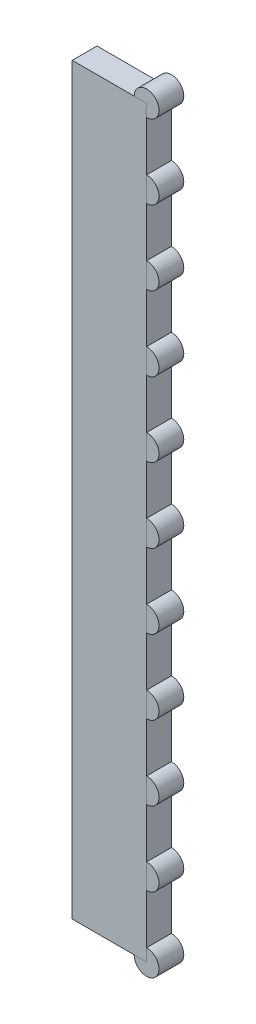
ISO-10303-21;
HEADER;
FILE_DESCRIPTION(('STEP AP214'),'2;1');
FILE_NAME('part.step','',(''),(''),'','','');
FILE_SCHEMA(('AUTOMOTIVE_DESIGN { 1 0 10303 214 1 1 1 1 }'));
ENDSEC;
DATA;
#1=APPLICATION_CONTEXT('core data for automotive mechanical design processes');
#2=APPLICATION_PROTOCOL_DEFINITION('international standard','automotive_design',2000,#1);
#3=PRODUCT_CONTEXT('',#1,'mechanical');
#4=PRODUCT('Part','Part','',(#3));
#5=PRODUCT_RELATED_PRODUCT_CATEGORY('part','',(#4));
#6=PRODUCT_DEFINITION_FORMATION('','',#4);
#7=PRODUCT_DEFINITION_CONTEXT('part definition',#1,'design');
#8=PRODUCT_DEFINITION('design','',#6,#7);
#9=PRODUCT_DEFINITION_SHAPE('','',#8);
#10=(LENGTH_UNIT() NAMED_UNIT(*) SI_UNIT(.MILLI.,.METRE.));
#11=(NAMED_UNIT(*) PLANE_ANGLE_UNIT() SI_UNIT($,.RADIAN.));
#12=(NAMED_UNIT(*) SI_UNIT($,.STERADIAN.) SOLID_ANGLE_UNIT());
#13=UNCERTAINTY_MEASURE_WITH_UNIT(LENGTH_MEASURE(1.E-05),#10,'distance_accuracy_value','');
#14=(GEOMETRIC_REPRESENTATION_CONTEXT(3) GLOBAL_UNCERTAINTY_ASSIGNED_CONTEXT((#13)) GLOBAL_UNIT_ASSIGNED_CONTEXT((#10,
#11,#12)) REPRESENTATION_CONTEXT('',''));
#15=CARTESIAN_POINT('',(0.,0.,0.));
#16=DIRECTION('',(0.,0.,1.));
#17=DIRECTION('',(1.,0.,0.));
#18=AXIS2_PLACEMENT_3D('',#15,#16,#17);
#19=CARTESIAN_POINT('',(30.0000000000031,0.,0.));
#20=DIRECTION('',(0.,0.,1.));
#21=DIRECTION('',(1.,0.,0.));
#22=AXIS2_PLACEMENT_3D('',#19,#20,#21);
#23=CYLINDRICAL_SURFACE('',#22,5.);
#24=CARTESIAN_POINT('',(30.0000000000031,0.,0.));
#25=DIRECTION('',(0.,0.,1.));
#26=DIRECTION('',(1.,0.,0.));
#27=AXIS2_PLACEMENT_3D('',#24,#25,#26);
#28=CIRCLE('',#27,5.);
#29=CARTESIAN_POINT('',(35.0000000000031,0.,0.));
#30=VERTEX_POINT('',#29);
#31=EDGE_CURVE('E11',#30,#30,#28,.T.);
#32=ORIENTED_EDGE('',*,*,#31,.T.);
#33=EDGE_LOOP('',(#32));
#34=FACE_BOUND('',#33,.T.);
#35=CARTESIAN_POINT('',(30.0000000000031,0.,10.));
#36=DIRECTION('',(0.,0.,1.));
#37=DIRECTION('',(1.,0.,0.));
#38=AXIS2_PLACEMENT_3D('',#35,#36,#37);
#39=CIRCLE('',#38,5.);
#40=CARTESIAN_POINT('',(35.0000000000031,0.,10.));
#41=VERTEX_POINT('',#40);
#42=EDGE_CURVE('E45',#41,#41,#39,.T.);
#43=ORIENTED_EDGE('',*,*,#42,.F.);
#44=EDGE_LOOP('',(#43));
#45=FACE_BOUND('',#44,.T.);
#46=ADVANCED_FACE('F42',(#34,#45),#23,.T.);
#47=CARTESIAN_POINT('',(30.0000000000031,0.,0.));
#48=DIRECTION('',(0.,0.,1.));
#49=DIRECTION('',(1.,0.,0.));
#50=AXIS2_PLACEMENT_3D('',#47,#48,#49);
#51=PLANE('',#50);
#52=ORIENTED_EDGE('',*,*,#31,.F.);
#53=EDGE_LOOP('',(#52));
#54=FACE_BOUND('',#53,.T.);
#55=ADVANCED_FACE('F57',(#54),#51,.F.);
#56=CARTESIAN_POINT('',(30.0000000000031,0.,10.));
#57=DIRECTION('',(0.,0.,1.));
#58=DIRECTION('',(1.,0.,0.));
#59=AXIS2_PLACEMENT_3D('',#56,#57,#58);
#60=PLANE('',#59);
#61=ORIENTED_EDGE('',*,*,#42,.T.);
#62=EDGE_LOOP('',(#61));
#63=FACE_BOUND('',#62,.T.);
#64=ADVANCED_FACE('F54',(#63),#60,.T.);
#65=CLOSED_SHELL('',(#46,#55,#64));
#66=MANIFOLD_SOLID_BREP('B2',#65);
#67=CARTESIAN_POINT('',(30.0000000000028,30.,0.));
#68=DIRECTION('',(0.,0.,1.));
#69=DIRECTION('',(1.,0.,0.));
#70=AXIS2_PLACEMENT_3D('',#67,#68,#69);
#71=CYLINDRICAL_SURFACE('',#70,5.);
#72=CARTESIAN_POINT('',(30.0000000000028,30.,0.));
#73=DIRECTION('',(0.,0.,1.));
#74=DIRECTION('',(1.,0.,0.));
#75=AXIS2_PLACEMENT_3D('',#72,#73,#74);
#76=CIRCLE('',#75,5.);
#77=CARTESIAN_POINT('',(35.0000000000028,30.,0.));
#78=VERTEX_POINT('',#77);
#79=EDGE_CURVE('E41',#78,#78,#76,.T.);
#80=ORIENTED_EDGE('',*,*,#79,.T.);
#81=EDGE_LOOP('',(#80));
#82=FACE_BOUND('',#81,.T.);
#83=CARTESIAN_POINT('',(30.0000000000028,30.,10.));
#84=DIRECTION('',(0.,0.,1.));
#85=DIRECTION('',(1.,0.,0.));
#86=AXIS2_PLACEMENT_3D('',#83,#84,#85);
#87=CIRCLE('',#86,5.);
#88=CARTESIAN_POINT('',(35.0000000000028,30.,10.));
#89=VERTEX_POINT('',#88);
#90=EDGE_CURVE('E94',#89,#89,#87,.T.);
#91=ORIENTED_EDGE('',*,*,#90,.F.);
#92=EDGE_LOOP('',(#91));
#93=FACE_BOUND('',#92,.T.);
#94=ADVANCED_FACE('F91',(#82,#93),#71,.T.);
#95=CARTESIAN_POINT('',(30.0000000000028,30.,0.));
#96=DIRECTION('',(0.,0.,1.));
#97=DIRECTION('',(1.,0.,0.));
#98=AXIS2_PLACEMENT_3D('',#95,#96,#97);
#99=PLANE('',#98);
#100=ORIENTED_EDGE('',*,*,#79,.F.);
#101=EDGE_LOOP('',(#100));
#102=FACE_BOUND('',#101,.T.);
#103=ADVANCED_FACE('F106',(#102),#99,.F.);
#104=CARTESIAN_POINT('',(30.0000000000028,30.,10.));
#105=DIRECTION('',(0.,0.,1.));
#106=DIRECTION('',(1.,0.,0.));
#107=AXIS2_PLACEMENT_3D('',#104,#105,#106);
#108=PLANE('',#107);
#109=ORIENTED_EDGE('',*,*,#90,.T.);
#110=EDGE_LOOP('',(#109));
#111=FACE_BOUND('',#110,.T.);
#112=ADVANCED_FACE('F103',(#111),#108,.T.);
#113=CLOSED_SHELL('',(#94,#103,#112));
#114=MANIFOLD_SOLID_BREP('B6',#113);
#115=CARTESIAN_POINT('',(30.0000000000025,60.,0.));
#116=DIRECTION('',(0.,0.,1.));
#117=DIRECTION('',(1.,0.,0.));
#118=AXIS2_PLACEMENT_3D('',#115,#116,#117);
#119=CYLINDRICAL_SURFACE('',#118,5.);
#120=CARTESIAN_POINT('',(30.0000000000025,60.,0.));
#121=DIRECTION('',(0.,0.,1.));
#122=DIRECTION('',(1.,0.,0.));
#123=AXIS2_PLACEMENT_3D('',#120,#121,#122);
#124=CIRCLE('',#123,5.);
#125=CARTESIAN_POINT('',(35.0000000000025,60.,0.));
#126=VERTEX_POINT('',#125);
#127=EDGE_CURVE('E90',#126,#126,#124,.T.);
#128=ORIENTED_EDGE('',*,*,#127,.T.);
#129=EDGE_LOOP('',(#128));
#130=FACE_BOUND('',#129,.T.);
#131=CARTESIAN_POINT('',(30.0000000000025,60.,10.));
#132=DIRECTION('',(0.,0.,1.));
#133=DIRECTION('',(1.,0.,0.));
#134=AXIS2_PLACEMENT_3D('',#131,#132,#133);
#135=CIRCLE('',#134,5.);
#136=CARTESIAN_POINT('',(35.0000000000025,60.,10.));
#137=VERTEX_POINT('',#136);
#138=EDGE_CURVE('E143',#137,#137,#135,.T.);
#139=ORIENTED_EDGE('',*,*,#138,.F.);
#140=EDGE_LOOP('',(#139));
#141=FACE_BOUND('',#140,.T.);
#142=ADVANCED_FACE('F140',(#130,#141),#119,.T.);
#143=CARTESIAN_POINT('',(30.0000000000025,60.,0.));
#144=DIRECTION('',(0.,0.,1.));
#145=DIRECTION('',(1.,0.,0.));
#146=AXIS2_PLACEMENT_3D('',#143,#144,#145);
#147=PLANE('',#146);
#148=ORIENTED_EDGE('',*,*,#127,.F.);
#149=EDGE_LOOP('',(#148));
#150=FACE_BOUND('',#149,.T.);
#151=ADVANCED_FACE('F155',(#150),#147,.F.);
#152=CARTESIAN_POINT('',(30.0000000000025,60.,10.));
#153=DIRECTION('',(0.,0.,1.));
#154=DIRECTION('',(1.,0.,0.));
#155=AXIS2_PLACEMENT_3D('',#152,#153,#154);
#156=PLANE('',#155);
#157=ORIENTED_EDGE('',*,*,#138,.T.);
#158=EDGE_LOOP('',(#157));
#159=FACE_BOUND('',#158,.T.);
#160=ADVANCED_FACE('F152',(#159),#156,.T.);
#161=CLOSED_SHELL('',(#142,#151,#160));
#162=MANIFOLD_SOLID_BREP('B36',#161);
#163=CARTESIAN_POINT('',(30.0000000000022,90.,0.));
#164=DIRECTION('',(0.,0.,1.));
#165=DIRECTION('',(1.,0.,0.));
#166=AXIS2_PLACEMENT_3D('',#163,#164,#165);
#167=CYLINDRICAL_SURFACE('',#166,5.);
#168=CARTESIAN_POINT('',(30.0000000000022,90.,0.));
#169=DIRECTION('',(0.,0.,1.));
#170=DIRECTION('',(1.,0.,0.));
#171=AXIS2_PLACEMENT_3D('',#168,#169,#170);
#172=CIRCLE('',#171,5.);
#173=CARTESIAN_POINT('',(35.0000000000022,90.,0.));
#174=VERTEX_POINT('',#173);
#175=EDGE_CURVE('E139',#174,#174,#172,.T.);
#176=ORIENTED_EDGE('',*,*,#175,.T.);
#177=EDGE_LOOP('',(#176));
#178=FACE_BOUND('',#177,.T.);
#179=CARTESIAN_POINT('',(30.0000000000022,90.,10.));
#180=DIRECTION('',(0.,0.,1.));
#181=DIRECTION('',(1.,0.,0.));
#182=AXIS2_PLACEMENT_3D('',#179,#180,#181);
#183=CIRCLE('',#182,5.);
#184=CARTESIAN_POINT('',(35.0000000000022,90.,10.));
#185=VERTEX_POINT('',#184);
#186=EDGE_CURVE('E192',#185,#185,#183,.T.);
#187=ORIENTED_EDGE('',*,*,#186,.F.);
#188=EDGE_LOOP('',(#187));
#189=FACE_BOUND('',#188,.T.);
#190=ADVANCED_FACE('F189',(#178,#189),#167,.T.);
#191=CARTESIAN_POINT('',(30.0000000000022,90.,0.));
#192=DIRECTION('',(0.,0.,1.));
#193=DIRECTION('',(1.,0.,0.));
#194=AXIS2_PLACEMENT_3D('',#191,#192,#193);
#195=PLANE('',#194);
#196=ORIENTED_EDGE('',*,*,#175,.F.);
#197=EDGE_LOOP('',(#196));
#198=FACE_BOUND('',#197,.T.);
#199=ADVANCED_FACE('F204',(#198),#195,.F.);
#200=CARTESIAN_POINT('',(30.0000000000022,90.,10.));
#201=DIRECTION('',(0.,0.,1.));
#202=DIRECTION('',(1.,0.,0.));
#203=AXIS2_PLACEMENT_3D('',#200,#201,#202);
#204=PLANE('',#203);
#205=ORIENTED_EDGE('',*,*,#186,.T.);
#206=EDGE_LOOP('',(#205));
#207=FACE_BOUND('',#206,.T.);
#208=ADVANCED_FACE('F201',(#207),#204,.T.);
#209=CLOSED_SHELL('',(#190,#199,#208));
#210=MANIFOLD_SOLID_BREP('B85',#209);
#211=CARTESIAN_POINT('',(30.0000000000019,120.,0.));
#212=DIRECTION('',(0.,0.,1.));
#213=DIRECTION('',(1.,0.,0.));
#214=AXIS2_PLACEMENT_3D('',#211,#212,#213);
#215=CYLINDRICAL_SURFACE('',#214,5.);
#216=CARTESIAN_POINT('',(30.0000000000019,120.,0.));
#217=DIRECTION('',(0.,0.,1.));
#218=DIRECTION('',(1.,0.,0.));
#219=AXIS2_PLACEMENT_3D('',#216,#217,#218);
#220=CIRCLE('',#219,5.);
#221=CARTESIAN_POINT('',(35.0000000000019,120.,0.));
#222=VERTEX_POINT('',#221);
#223=EDGE_CURVE('E188',#222,#222,#220,.T.);
#224=ORIENTED_EDGE('',*,*,#223,.T.);
#225=EDGE_LOOP('',(#224));
#226=FACE_BOUND('',#225,.T.);
#227=CARTESIAN_POINT('',(30.0000000000019,120.,10.));
#228=DIRECTION('',(0.,0.,1.));
#229=DIRECTION('',(1.,0.,0.));
#230=AXIS2_PLACEMENT_3D('',#227,#228,#229);
#231=CIRCLE('',#230,5.);
#232=CARTESIAN_POINT('',(35.0000000000019,120.,10.));
#233=VERTEX_POINT('',#232);
#234=EDGE_CURVE('E241',#233,#233,#231,.T.);
#235=ORIENTED_EDGE('',*,*,#234,.F.);
#236=EDGE_LOOP('',(#235));
#237=FACE_BOUND('',#236,.T.);
#238=ADVANCED_FACE('F238',(#226,#237),#215,.T.);
#239=CARTESIAN_POINT('',(30.0000000000019,120.,0.));
#240=DIRECTION('',(0.,0.,1.));
#241=DIRECTION('',(1.,0.,0.));
#242=AXIS2_PLACEMENT_3D('',#239,#240,#241);
#243=PLANE('',#242);
#244=ORIENTED_EDGE('',*,*,#223,.F.);
#245=EDGE_LOOP('',(#244));
#246=FACE_BOUND('',#245,.T.);
#247=ADVANCED_FACE('F253',(#246),#243,.F.);
#248=CARTESIAN_POINT('',(30.0000000000019,120.,10.));
#249=DIRECTION('',(0.,0.,1.));
#250=DIRECTION('',(1.,0.,0.));
#251=AXIS2_PLACEMENT_3D('',#248,#249,#250);
#252=PLANE('',#251);
#253=ORIENTED_EDGE('',*,*,#234,.T.);
#254=EDGE_LOOP('',(#253));
#255=FACE_BOUND('',#254,.T.);
#256=ADVANCED_FACE('F250',(#255),#252,.T.);
#257=CLOSED_SHELL('',(#238,#247,#256));
#258=MANIFOLD_SOLID_BREP('B134',#257);
#259=CARTESIAN_POINT('',(30.0000000000016,150.,0.));
#260=DIRECTION('',(0.,0.,1.));
#261=DIRECTION('',(1.,0.,0.));
#262=AXIS2_PLACEMENT_3D('',#259,#260,#261);
#263=CYLINDRICAL_SURFACE('',#262,5.);
#264=CARTESIAN_POINT('',(30.0000000000016,150.,0.));
#265=DIRECTION('',(0.,0.,1.));
#266=DIRECTION('',(1.,0.,0.));
#267=AXIS2_PLACEMENT_3D('',#264,#265,#266);
#268=CIRCLE('',#267,5.);
#269=CARTESIAN_POINT('',(35.0000000000016,150.,0.));
#270=VERTEX_POINT('',#269);
#271=EDGE_CURVE('E237',#270,#270,#268,.T.);
#272=ORIENTED_EDGE('',*,*,#271,.T.);
#273=EDGE_LOOP('',(#272));
#274=FACE_BOUND('',#273,.T.);
#275=CARTESIAN_POINT('',(30.0000000000016,150.,10.));
#276=DIRECTION('',(0.,0.,1.));
#277=DIRECTION('',(1.,0.,0.));
#278=AXIS2_PLACEMENT_3D('',#275,#276,#277);
#279=CIRCLE('',#278,5.);
#280=CARTESIAN_POINT('',(35.0000000000016,150.,10.));
#281=VERTEX_POINT('',#280);
#282=EDGE_CURVE('E290',#281,#281,#279,.T.);
#283=ORIENTED_EDGE('',*,*,#282,.F.);
#284=EDGE_LOOP('',(#283));
#285=FACE_BOUND('',#284,.T.);
#286=ADVANCED_FACE('F287',(#274,#285),#263,.T.);
#287=CARTESIAN_POINT('',(30.0000000000016,150.,0.));
#288=DIRECTION('',(0.,0.,1.));
#289=DIRECTION('',(1.,0.,0.));
#290=AXIS2_PLACEMENT_3D('',#287,#288,#289);
#291=PLANE('',#290);
#292=ORIENTED_EDGE('',*,*,#271,.F.);
#293=EDGE_LOOP('',(#292));
#294=FACE_BOUND('',#293,.T.);
#295=ADVANCED_FACE('F302',(#294),#291,.F.);
#296=CARTESIAN_POINT('',(30.0000000000016,150.,10.));
#297=DIRECTION('',(0.,0.,1.));
#298=DIRECTION('',(1.,0.,0.));
#299=AXIS2_PLACEMENT_3D('',#296,#297,#298);
#300=PLANE('',#299);
#301=ORIENTED_EDGE('',*,*,#282,.T.);
#302=EDGE_LOOP('',(#301));
#303=FACE_BOUND('',#302,.T.);
#304=ADVANCED_FACE('F299',(#303),#300,.T.);
#305=CLOSED_SHELL('',(#286,#295,#304));
#306=MANIFOLD_SOLID_BREP('B183',#305);
#307=CARTESIAN_POINT('',(30.0000000000012,180.,0.));
#308=DIRECTION('',(0.,0.,1.));
#309=DIRECTION('',(1.,0.,0.));
#310=AXIS2_PLACEMENT_3D('',#307,#308,#309);
#311=CYLINDRICAL_SURFACE('',#310,5.);
#312=CARTESIAN_POINT('',(30.0000000000012,180.,0.));
#313=DIRECTION('',(0.,0.,1.));
#314=DIRECTION('',(1.,0.,0.));
#315=AXIS2_PLACEMENT_3D('',#312,#313,#314);
#316=CIRCLE('',#315,5.);
#317=CARTESIAN_POINT('',(35.0000000000012,180.,0.));
#318=VERTEX_POINT('',#317);
#319=EDGE_CURVE('E286',#318,#318,#316,.T.);
#320=ORIENTED_EDGE('',*,*,#319,.T.);
#321=EDGE_LOOP('',(#320));
#322=FACE_BOUND('',#321,.T.);
#323=CARTESIAN_POINT('',(30.0000000000012,180.,10.));
#324=DIRECTION('',(0.,0.,1.));
#325=DIRECTION('',(1.,0.,0.));
#326=AXIS2_PLACEMENT_3D('',#323,#324,#325);
#327=CIRCLE('',#326,5.);
#328=CARTESIAN_POINT('',(35.0000000000012,180.,10.));
#329=VERTEX_POINT('',#328);
#330=EDGE_CURVE('E339',#329,#329,#327,.T.);
#331=ORIENTED_EDGE('',*,*,#330,.F.);
#332=EDGE_LOOP('',(#331));
#333=FACE_BOUND('',#332,.T.);
#334=ADVANCED_FACE('F336',(#322,#333),#311,.T.);
#335=CARTESIAN_POINT('',(30.0000000000012,180.,0.));
#336=DIRECTION('',(0.,0.,1.));
#337=DIRECTION('',(1.,0.,0.));
#338=AXIS2_PLACEMENT_3D('',#335,#336,#337);
#339=PLANE('',#338);
#340=ORIENTED_EDGE('',*,*,#319,.F.);
#341=EDGE_LOOP('',(#340));
#342=FACE_BOUND('',#341,.T.);
#343=ADVANCED_FACE('F351',(#342),#339,.F.);
#344=CARTESIAN_POINT('',(30.0000000000012,180.,10.));
#345=DIRECTION('',(0.,0.,1.));
#346=DIRECTION('',(1.,0.,0.));
#347=AXIS2_PLACEMENT_3D('',#344,#345,#346);
#348=PLANE('',#347);
#349=ORIENTED_EDGE('',*,*,#330,.T.);
#350=EDGE_LOOP('',(#349));
#351=FACE_BOUND('',#350,.T.);
#352=ADVANCED_FACE('F348',(#351),#348,.T.);
#353=CLOSED_SHELL('',(#334,#343,#352));
#354=MANIFOLD_SOLID_BREP('B232',#353);
#355=CARTESIAN_POINT('',(30.0000000000009,210.,0.));
#356=DIRECTION('',(0.,0.,1.));
#357=DIRECTION('',(1.,0.,0.));
#358=AXIS2_PLACEMENT_3D('',#355,#356,#357);
#359=CYLINDRICAL_SURFACE('',#358,5.);
#360=CARTESIAN_POINT('',(30.0000000000009,210.,0.));
#361=DIRECTION('',(0.,0.,1.));
#362=DIRECTION('',(1.,0.,0.));
#363=AXIS2_PLACEMENT_3D('',#360,#361,#362);
#364=CIRCLE('',#363,5.);
#365=CARTESIAN_POINT('',(35.0000000000009,210.,0.));
#366=VERTEX_POINT('',#365);
#367=EDGE_CURVE('E335',#366,#366,#364,.T.);
#368=ORIENTED_EDGE('',*,*,#367,.T.);
#369=EDGE_LOOP('',(#368));
#370=FACE_BOUND('',#369,.T.);
#371=CARTESIAN_POINT('',(30.0000000000009,210.,10.));
#372=DIRECTION('',(0.,0.,1.));
#373=DIRECTION('',(1.,0.,0.));
#374=AXIS2_PLACEMENT_3D('',#371,#372,#373);
#375=CIRCLE('',#374,5.);
#376=CARTESIAN_POINT('',(35.0000000000009,210.,10.));
#377=VERTEX_POINT('',#376);
#378=EDGE_CURVE('E388',#377,#377,#375,.T.);
#379=ORIENTED_EDGE('',*,*,#378,.F.);
#380=EDGE_LOOP('',(#379));
#381=FACE_BOUND('',#380,.T.);
#382=ADVANCED_FACE('F385',(#370,#381),#359,.T.);
#383=CARTESIAN_POINT('',(30.0000000000009,210.,0.));
#384=DIRECTION('',(0.,0.,1.));
#385=DIRECTION('',(1.,0.,0.));
#386=AXIS2_PLACEMENT_3D('',#383,#384,#385);
#387=PLANE('',#386);
#388=ORIENTED_EDGE('',*,*,#367,.F.);
#389=EDGE_LOOP('',(#388));
#390=FACE_BOUND('',#389,.T.);
#391=ADVANCED_FACE('F400',(#390),#387,.F.);
#392=CARTESIAN_POINT('',(30.0000000000009,210.,10.));
#393=DIRECTION('',(0.,0.,1.));
#394=DIRECTION('',(1.,0.,0.));
#395=AXIS2_PLACEMENT_3D('',#392,#393,#394);
#396=PLANE('',#395);
#397=ORIENTED_EDGE('',*,*,#378,.T.);
#398=EDGE_LOOP('',(#397));
#399=FACE_BOUND('',#398,.T.);
#400=ADVANCED_FACE('F397',(#399),#396,.T.);
#401=CLOSED_SHELL('',(#382,#391,#400));
#402=MANIFOLD_SOLID_BREP('B281',#401);
#403=CARTESIAN_POINT('',(30.0000000000006,240.,0.));
#404=DIRECTION('',(0.,0.,1.));
#405=DIRECTION('',(1.,0.,0.));
#406=AXIS2_PLACEMENT_3D('',#403,#404,#405);
#407=CYLINDRICAL_SURFACE('',#406,5.);
#408=CARTESIAN_POINT('',(30.0000000000006,240.,0.));
#409=DIRECTION('',(0.,0.,1.));
#410=DIRECTION('',(1.,0.,0.));
#411=AXIS2_PLACEMENT_3D('',#408,#409,#410);
#412=CIRCLE('',#411,5.);
#413=CARTESIAN_POINT('',(35.0000000000006,240.,0.));
#414=VERTEX_POINT('',#413);
#415=EDGE_CURVE('E384',#414,#414,#412,.T.);
#416=ORIENTED_EDGE('',*,*,#415,.T.);
#417=EDGE_LOOP('',(#416));
#418=FACE_BOUND('',#417,.T.);
#419=CARTESIAN_POINT('',(30.0000000000006,240.,10.));
#420=DIRECTION('',(0.,0.,1.));
#421=DIRECTION('',(1.,0.,0.));
#422=AXIS2_PLACEMENT_3D('',#419,#420,#421);
#423=CIRCLE('',#422,5.);
#424=CARTESIAN_POINT('',(35.0000000000006,240.,10.));
#425=VERTEX_POINT('',#424);
#426=EDGE_CURVE('E437',#425,#425,#423,.T.);
#427=ORIENTED_EDGE('',*,*,#426,.F.);
#428=EDGE_LOOP('',(#427));
#429=FACE_BOUND('',#428,.T.);
#430=ADVANCED_FACE('F434',(#418,#429),#407,.T.);
#431=CARTESIAN_POINT('',(30.0000000000006,240.,0.));
#432=DIRECTION('',(0.,0.,1.));
#433=DIRECTION('',(1.,0.,0.));
#434=AXIS2_PLACEMENT_3D('',#431,#432,#433);
#435=PLANE('',#434);
#436=ORIENTED_EDGE('',*,*,#415,.F.);
#437=EDGE_LOOP('',(#436));
#438=FACE_BOUND('',#437,.T.);
#439=ADVANCED_FACE('F449',(#438),#435,.F.);
#440=CARTESIAN_POINT('',(30.0000000000006,240.,10.));
#441=DIRECTION('',(0.,0.,1.));
#442=DIRECTION('',(1.,0.,0.));
#443=AXIS2_PLACEMENT_3D('',#440,#441,#442);
#444=PLANE('',#443);
#445=ORIENTED_EDGE('',*,*,#426,.T.);
#446=EDGE_LOOP('',(#445));
#447=FACE_BOUND('',#446,.T.);
#448=ADVANCED_FACE('F446',(#447),#444,.T.);
#449=CLOSED_SHELL('',(#430,#439,#448));
#450=MANIFOLD_SOLID_BREP('B330',#449);
#451=CARTESIAN_POINT('',(30.0000000000003,270.,0.));
#452=DIRECTION('',(0.,0.,1.));
#453=DIRECTION('',(1.,0.,0.));
#454=AXIS2_PLACEMENT_3D('',#451,#452,#453);
#455=CYLINDRICAL_SURFACE('',#454,5.);
#456=CARTESIAN_POINT('',(30.0000000000003,270.,0.));
#457=DIRECTION('',(0.,0.,1.));
#458=DIRECTION('',(1.,0.,0.));
#459=AXIS2_PLACEMENT_3D('',#456,#457,#458);
#460=CIRCLE('',#459,5.);
#461=CARTESIAN_POINT('',(35.0000000000003,270.,0.));
#462=VERTEX_POINT('',#461);
#463=EDGE_CURVE('E433',#462,#462,#460,.T.);
#464=ORIENTED_EDGE('',*,*,#463,.T.);
#465=EDGE_LOOP('',(#464));
#466=FACE_BOUND('',#465,.T.);
#467=CARTESIAN_POINT('',(30.0000000000003,270.,10.));
#468=DIRECTION('',(0.,0.,1.));
#469=DIRECTION('',(1.,0.,0.));
#470=AXIS2_PLACEMENT_3D('',#467,#468,#469);
#471=CIRCLE('',#470,5.);
#472=CARTESIAN_POINT('',(35.0000000000003,270.,10.));
#473=VERTEX_POINT('',#472);
#474=EDGE_CURVE('E486',#473,#473,#471,.T.);
#475=ORIENTED_EDGE('',*,*,#474,.F.);
#476=EDGE_LOOP('',(#475));
#477=FACE_BOUND('',#476,.T.);
#478=ADVANCED_FACE('F483',(#466,#477),#455,.T.);
#479=CARTESIAN_POINT('',(30.0000000000003,270.,0.));
#480=DIRECTION('',(0.,0.,1.));
#481=DIRECTION('',(1.,0.,0.));
#482=AXIS2_PLACEMENT_3D('',#479,#480,#481);
#483=PLANE('',#482);
#484=ORIENTED_EDGE('',*,*,#463,.F.);
#485=EDGE_LOOP('',(#484));
#486=FACE_BOUND('',#485,.T.);
#487=ADVANCED_FACE('F498',(#486),#483,.F.);
#488=CARTESIAN_POINT('',(30.0000000000003,270.,10.));
#489=DIRECTION('',(0.,0.,1.));
#490=DIRECTION('',(1.,0.,0.));
#491=AXIS2_PLACEMENT_3D('',#488,#489,#490);
#492=PLANE('',#491);
#493=ORIENTED_EDGE('',*,*,#474,.T.);
#494=EDGE_LOOP('',(#493));
#495=FACE_BOUND('',#494,.T.);
#496=ADVANCED_FACE('F495',(#495),#492,.T.);
#497=CLOSED_SHELL('',(#478,#487,#496));
#498=MANIFOLD_SOLID_BREP('B379',#497);
#499=CARTESIAN_POINT('',(30.,300.,0.));
#500=DIRECTION('',(0.,0.,1.));
#501=DIRECTION('',(1.,0.,0.));
#502=AXIS2_PLACEMENT_3D('',#499,#500,#501);
#503=CYLINDRICAL_SURFACE('',#502,5.);
#504=CARTESIAN_POINT('',(30.,300.,0.));
#505=DIRECTION('',(0.,0.,1.));
#506=DIRECTION('',(1.,0.,0.));
#507=AXIS2_PLACEMENT_3D('',#504,#505,#506);
#508=CIRCLE('',#507,5.);
#509=CARTESIAN_POINT('',(35.,300.,0.));
#510=VERTEX_POINT('',#509);
#511=EDGE_CURVE('E482',#510,#510,#508,.T.);
#512=ORIENTED_EDGE('',*,*,#511,.T.);
#513=EDGE_LOOP('',(#512));
#514=FACE_BOUND('',#513,.T.);
#515=CARTESIAN_POINT('',(30.,300.,10.));
#516=DIRECTION('',(0.,0.,1.));
#517=DIRECTION('',(1.,0.,0.));
#518=AXIS2_PLACEMENT_3D('',#515,#516,#517);
#519=CIRCLE('',#518,5.);
#520=CARTESIAN_POINT('',(35.,300.,10.));
#521=VERTEX_POINT('',#520);
#522=EDGE_CURVE('E536',#521,#521,#519,.T.);
#523=ORIENTED_EDGE('',*,*,#522,.F.);
#524=EDGE_LOOP('',(#523));
#525=FACE_BOUND('',#524,.T.);
#526=ADVANCED_FACE('F533',(#514,#525),#503,.T.);
#527=CARTESIAN_POINT('',(30.,300.,0.));
#528=DIRECTION('',(0.,0.,1.));
#529=DIRECTION('',(1.,0.,0.));
#530=AXIS2_PLACEMENT_3D('',#527,#528,#529);
#531=PLANE('',#530);
#532=ORIENTED_EDGE('',*,*,#511,.F.);
#533=EDGE_LOOP('',(#532));
#534=FACE_BOUND('',#533,.T.);
#535=ADVANCED_FACE('F548',(#534),#531,.F.);
#536=CARTESIAN_POINT('',(30.,300.,10.));
#537=DIRECTION('',(0.,0.,1.));
#538=DIRECTION('',(1.,0.,0.));
#539=AXIS2_PLACEMENT_3D('',#536,#537,#538);
#540=PLANE('',#539);
#541=ORIENTED_EDGE('',*,*,#522,.T.);
#542=EDGE_LOOP('',(#541));
#543=FACE_BOUND('',#542,.T.);
#544=ADVANCED_FACE('F545',(#543),#540,.T.);
#545=CLOSED_SHELL('',(#526,#535,#544));
#546=MANIFOLD_SOLID_BREP('B428',#545);
#547=CARTESIAN_POINT('',(0.,300.,10.));
#548=DIRECTION('',(1.,0.,0.));
#549=DIRECTION('',(0.,0.,-1.));
#550=AXIS2_PLACEMENT_3D('',#547,#548,#549);
#551=PLANE('',#550);
#552=DIRECTION('',(0.,-1.,0.));
#553=VECTOR('',#552,1.);
#554=CARTESIAN_POINT('',(0.,300.,0.));
#555=LINE('',#554,#553);
#556=CARTESIAN_POINT('',(0.,300.,0.));
#557=VERTEX_POINT('',#556);
#558=CARTESIAN_POINT('',(0.,0.,0.));
#559=VERTEX_POINT('',#558);
#560=EDGE_CURVE('E637',#557,#559,#555,.T.);
#561=ORIENTED_EDGE('',*,*,#560,.T.);
#562=DIRECTION('',(0.,0.,-1.));
#563=VECTOR('',#562,1.);
#564=CARTESIAN_POINT('',(0.,0.,10.));
#565=LINE('',#564,#563);
#566=CARTESIAN_POINT('',(0.,0.,10.));
#567=VERTEX_POINT('',#566);
#568=EDGE_CURVE('E531',#567,#559,#565,.T.);
#569=ORIENTED_EDGE('',*,*,#568,.F.);
#570=DIRECTION('',(0.,-1.,0.));
#571=VECTOR('',#570,1.);
#572=CARTESIAN_POINT('',(0.,300.,10.));
#573=LINE('',#572,#571);
#574=CARTESIAN_POINT('',(0.,300.,10.));
#575=VERTEX_POINT('',#574);
#576=EDGE_CURVE('E625',#575,#567,#573,.T.);
#577=ORIENTED_EDGE('',*,*,#576,.F.);
#578=DIRECTION('',(0.,0.,-1.));
#579=VECTOR('',#578,1.);
#580=CARTESIAN_POINT('',(0.,300.,10.));
#581=LINE('',#580,#579);
#582=EDGE_CURVE('E633',#575,#557,#581,.T.);
#583=ORIENTED_EDGE('',*,*,#582,.T.);
#584=EDGE_LOOP('',(#561,#569,#577,#583));
#585=FACE_BOUND('',#584,.T.);
#586=ADVANCED_FACE('F574',(#585),#551,.F.);
#587=CARTESIAN_POINT('',(0.,0.,10.));
#588=DIRECTION('',(0.,1.,0.));
#589=DIRECTION('',(-1.,0.,0.));
#590=AXIS2_PLACEMENT_3D('',#587,#588,#589);
#591=PLANE('',#590);
#592=DIRECTION('',(1.,0.,0.));
#593=VECTOR('',#592,1.);
#594=CARTESIAN_POINT('',(0.,0.,0.));
#595=LINE('',#594,#593);
#596=CARTESIAN_POINT('',(30.,0.,0.));
#597=VERTEX_POINT('',#596);
#598=EDGE_CURVE('E629',#559,#597,#595,.T.);
#599=ORIENTED_EDGE('',*,*,#598,.T.);
#600=DIRECTION('',(0.,0.,-1.));
#601=VECTOR('',#600,1.);
#602=CARTESIAN_POINT('',(30.,0.,10.));
#603=LINE('',#602,#601);
#604=CARTESIAN_POINT('',(30.,0.,10.));
#605=VERTEX_POINT('',#604);
#606=EDGE_CURVE('E582',#605,#597,#603,.T.);
#607=ORIENTED_EDGE('',*,*,#606,.F.);
#608=DIRECTION('',(1.,0.,0.));
#609=VECTOR('',#608,1.);
#610=CARTESIAN_POINT('',(0.,0.,10.));
#611=LINE('',#610,#609);
#612=EDGE_CURVE('E620',#567,#605,#611,.T.);
#613=ORIENTED_EDGE('',*,*,#612,.F.);
#614=ORIENTED_EDGE('',*,*,#568,.T.);
#615=EDGE_LOOP('',(#599,#607,#613,#614));
#616=FACE_BOUND('',#615,.T.);
#617=ADVANCED_FACE('F628',(#616),#591,.F.);
#618=CARTESIAN_POINT('',(30.,300.,10.));
#619=DIRECTION('',(-1.,0.,0.));
#620=DIRECTION('',(0.,-1.,0.));
#621=AXIS2_PLACEMENT_3D('',#618,#619,#620);
#622=PLANE('',#621);
#623=DIRECTION('',(0.,1.,0.));
#624=VECTOR('',#623,1.);
#625=CARTESIAN_POINT('',(30.,300.,0.));
#626=LINE('',#625,#624);
#627=CARTESIAN_POINT('',(30.,300.,0.));
#628=VERTEX_POINT('',#627);
#629=EDGE_CURVE('E607',#597,#628,#626,.T.);
#630=ORIENTED_EDGE('',*,*,#629,.T.);
#631=DIRECTION('',(0.,0.,-1.));
#632=VECTOR('',#631,1.);
#633=CARTESIAN_POINT('',(30.,300.,10.));
#634=LINE('',#633,#632);
#635=CARTESIAN_POINT('',(30.,300.,10.));
#636=VERTEX_POINT('',#635);
#637=EDGE_CURVE('E630',#636,#628,#634,.T.);
#638=ORIENTED_EDGE('',*,*,#637,.F.);
#639=DIRECTION('',(0.,1.,0.));
#640=VECTOR('',#639,1.);
#641=CARTESIAN_POINT('',(30.,300.,10.));
#642=LINE('',#641,#640);
#643=EDGE_CURVE('E623',#605,#636,#642,.T.);
#644=ORIENTED_EDGE('',*,*,#643,.F.);
#645=ORIENTED_EDGE('',*,*,#606,.T.);
#646=EDGE_LOOP('',(#630,#638,#644,#645));
#647=FACE_BOUND('',#646,.T.);
#648=ADVANCED_FACE('F631',(#647),#622,.F.);
#649=CARTESIAN_POINT('',(0.,300.,10.));
#650=DIRECTION('',(0.,-1.,0.));
#651=DIRECTION('',(0.,0.,-1.));
#652=AXIS2_PLACEMENT_3D('',#649,#650,#651);
#653=PLANE('',#652);
#654=DIRECTION('',(-1.,0.,0.));
#655=VECTOR('',#654,1.);
#656=CARTESIAN_POINT('',(0.,300.,0.));
#657=LINE('',#656,#655);
#658=EDGE_CURVE('E613',#628,#557,#657,.T.);
#659=ORIENTED_EDGE('',*,*,#658,.T.);
#660=ORIENTED_EDGE('',*,*,#582,.F.);
#661=DIRECTION('',(-1.,0.,0.));
#662=VECTOR('',#661,1.);
#663=CARTESIAN_POINT('',(0.,300.,10.));
#664=LINE('',#663,#662);
#665=EDGE_CURVE('E590',#636,#575,#664,.T.);
#666=ORIENTED_EDGE('',*,*,#665,.F.);
#667=ORIENTED_EDGE('',*,*,#637,.T.);
#668=EDGE_LOOP('',(#659,#660,#666,#667));
#669=FACE_BOUND('',#668,.T.);
#670=ADVANCED_FACE('F644',(#669),#653,.F.);
#671=CARTESIAN_POINT('',(0.,0.,10.));
#672=DIRECTION('',(0.,0.,1.));
#673=DIRECTION('',(1.,0.,0.));
#674=AXIS2_PLACEMENT_3D('',#671,#672,#673);
#675=PLANE('',#674);
#676=ORIENTED_EDGE('',*,*,#576,.T.);
#677=ORIENTED_EDGE('',*,*,#612,.T.);
#678=ORIENTED_EDGE('',*,*,#643,.T.);
#679=ORIENTED_EDGE('',*,*,#665,.T.);
#680=EDGE_LOOP('',(#676,#677,#678,#679));
#681=FACE_BOUND('',#680,.T.);
#682=ADVANCED_FACE('F621',(#681),#675,.T.);
#683=CARTESIAN_POINT('',(0.,0.,0.));
#684=DIRECTION('',(0.,0.,1.));
#685=DIRECTION('',(1.,0.,0.));
#686=AXIS2_PLACEMENT_3D('',#683,#684,#685);
#687=PLANE('',#686);
#688=ORIENTED_EDGE('',*,*,#560,.F.);
#689=ORIENTED_EDGE('',*,*,#658,.F.);
#690=ORIENTED_EDGE('',*,*,#629,.F.);
#691=ORIENTED_EDGE('',*,*,#598,.F.);
#692=EDGE_LOOP('',(#688,#689,#690,#691));
#693=FACE_BOUND('',#692,.T.);
#694=ADVANCED_FACE('F647',(#693),#687,.F.);
#695=CLOSED_SHELL('',(#586,#617,#648,#670,#682,#694));
#696=MANIFOLD_SOLID_BREP('B477',#695);
#697=ADVANCED_BREP_SHAPE_REPRESENTATION('',(#18,#66,#114,#162,#210,#258,#306,#354,#402,#450,
#498,#546,#696),#14);
#698=SHAPE_DEFINITION_REPRESENTATION(#9,#697);
ENDSEC;
END-ISO-10303-21;
